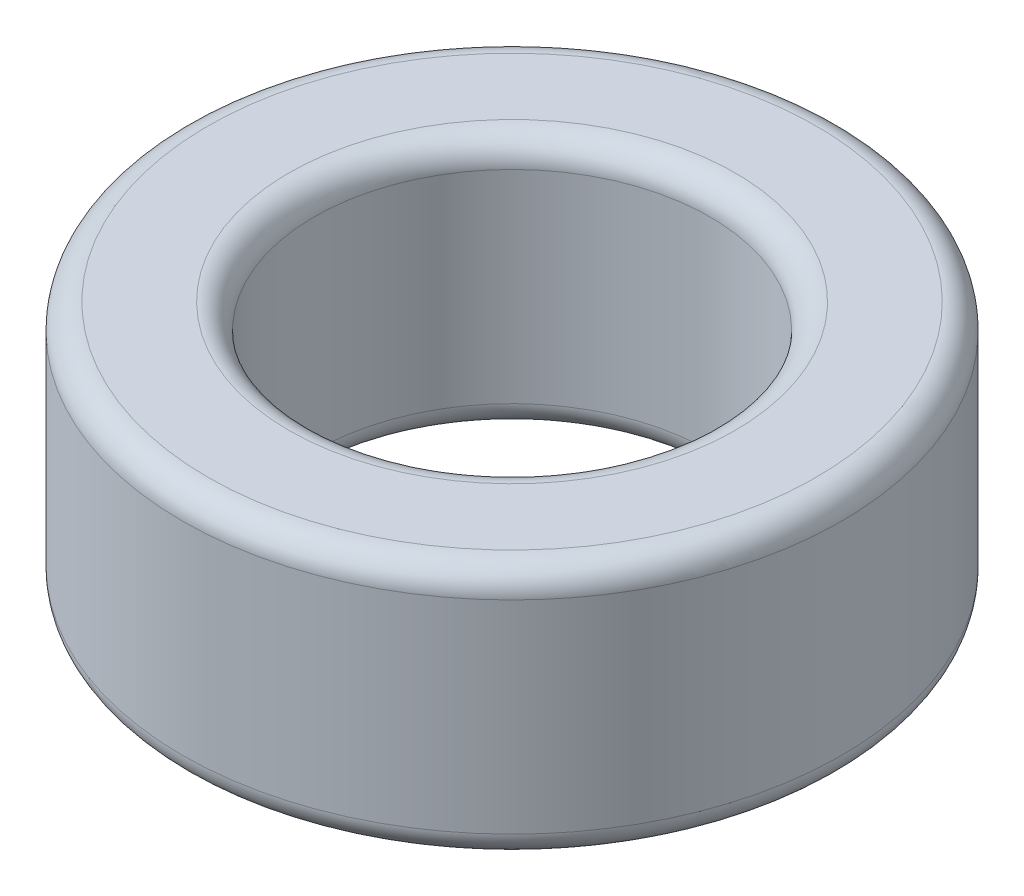
ISO-10303-21;
HEADER;
FILE_DESCRIPTION(('STEP AP214'),'2;1');
FILE_NAME('part.step','',(''),(''),'','','');
FILE_SCHEMA(('AUTOMOTIVE_DESIGN { 1 0 10303 214 1 1 1 1 }'));
ENDSEC;
DATA;
#1=APPLICATION_CONTEXT('core data for automotive mechanical design processes');
#2=APPLICATION_PROTOCOL_DEFINITION('international standard','automotive_design',2000,#1);
#3=PRODUCT_CONTEXT('',#1,'mechanical');
#4=PRODUCT('Part','Part','',(#3));
#5=PRODUCT_RELATED_PRODUCT_CATEGORY('part','',(#4));
#6=PRODUCT_DEFINITION_FORMATION('','',#4);
#7=PRODUCT_DEFINITION_CONTEXT('part definition',#1,'design');
#8=PRODUCT_DEFINITION('design','',#6,#7);
#9=PRODUCT_DEFINITION_SHAPE('','',#8);
#10=(LENGTH_UNIT() NAMED_UNIT(*) SI_UNIT(.MILLI.,.METRE.));
#11=(NAMED_UNIT(*) PLANE_ANGLE_UNIT() SI_UNIT($,.RADIAN.));
#12=(NAMED_UNIT(*) SI_UNIT($,.STERADIAN.) SOLID_ANGLE_UNIT());
#13=UNCERTAINTY_MEASURE_WITH_UNIT(LENGTH_MEASURE(1.E-05),#10,'distance_accuracy_value','');
#14=(GEOMETRIC_REPRESENTATION_CONTEXT(3) GLOBAL_UNCERTAINTY_ASSIGNED_CONTEXT((#13)) GLOBAL_UNIT_ASSIGNED_CONTEXT((#10,
#11,#12)) REPRESENTATION_CONTEXT('',''));
#15=CARTESIAN_POINT('',(0.,0.,0.));
#16=DIRECTION('',(0.,0.,1.));
#17=DIRECTION('',(1.,0.,0.));
#18=AXIS2_PLACEMENT_3D('',#15,#16,#17);
#19=CARTESIAN_POINT('',(0.,-2.5,8.22));
#20=DIRECTION('',(0.,1.,0.));
#21=DIRECTION('',(1.,0.,0.));
#22=AXIS2_PLACEMENT_3D('',#19,#20,#21);
#23=PLANE('',#22);
#24=CARTESIAN_POINT('',(0.,-2.5,8.22));
#25=DIRECTION('',(0.,1.,0.));
#26=DIRECTION('',(0.,0.,1.));
#27=AXIS2_PLACEMENT_3D('',#24,#25,#26);
#28=CIRCLE('',#27,4.4);
#29=CARTESIAN_POINT('',(0.,-2.5,12.62));
#30=VERTEX_POINT('',#29);
#31=EDGE_CURVE('E26',#30,#30,#28,.T.);
#32=ORIENTED_EDGE('',*,*,#31,.T.);
#33=EDGE_LOOP('',(#32));
#34=FACE_BOUND('',#33,.T.);
#35=CARTESIAN_POINT('',(0.,-2.5,8.22));
#36=DIRECTION('',(0.,-1.,0.));
#37=DIRECTION('',(0.,0.,1.));
#38=AXIS2_PLACEMENT_3D('',#35,#36,#37);
#39=CIRCLE('',#38,6.);
#40=CARTESIAN_POINT('',(0.,-2.5,14.22));
#41=VERTEX_POINT('',#40);
#42=EDGE_CURVE('E84',#41,#41,#39,.T.);
#43=ORIENTED_EDGE('',*,*,#42,.T.);
#44=EDGE_LOOP('',(#43));
#45=FACE_BOUND('',#44,.T.);
#46=ADVANCED_FACE('F17',(#34,#45),#23,.F.);
#47=CARTESIAN_POINT('',(0.,-2.5,8.22));
#48=DIRECTION('',(0.,-1.,0.));
#49=DIRECTION('',(0.,0.,1.));
#50=AXIS2_PLACEMENT_3D('',#47,#48,#49);
#51=CYLINDRICAL_SURFACE('',#50,6.5);
#52=CARTESIAN_POINT('',(0.,2.,8.22));
#53=DIRECTION('',(0.,-1.,0.));
#54=DIRECTION('',(0.,0.,1.));
#55=AXIS2_PLACEMENT_3D('',#52,#53,#54);
#56=CIRCLE('',#55,6.5);
#57=CARTESIAN_POINT('',(0.,2.,14.72));
#58=VERTEX_POINT('',#57);
#59=EDGE_CURVE('E67',#58,#58,#56,.T.);
#60=ORIENTED_EDGE('',*,*,#59,.T.);
#61=EDGE_LOOP('',(#60));
#62=FACE_BOUND('',#61,.T.);
#63=CARTESIAN_POINT('',(0.,-2.,8.22));
#64=DIRECTION('',(0.,1.,0.));
#65=DIRECTION('',(0.,0.,1.));
#66=AXIS2_PLACEMENT_3D('',#63,#64,#65);
#67=CIRCLE('',#66,6.5);
#68=CARTESIAN_POINT('',(0.,-2.,14.72));
#69=VERTEX_POINT('',#68);
#70=EDGE_CURVE('E87',#69,#69,#67,.T.);
#71=ORIENTED_EDGE('',*,*,#70,.T.);
#72=EDGE_LOOP('',(#71));
#73=FACE_BOUND('',#72,.T.);
#74=ADVANCED_FACE('F68',(#62,#73),#51,.T.);
#75=CARTESIAN_POINT('',(0.,-2.5,8.22));
#76=DIRECTION('',(0.,-1.,0.));
#77=DIRECTION('',(0.,0.,1.));
#78=AXIS2_PLACEMENT_3D('',#75,#76,#77);
#79=CYLINDRICAL_SURFACE('',#78,3.9);
#80=CARTESIAN_POINT('',(0.,-2.,8.22));
#81=DIRECTION('',(0.,-1.,0.));
#82=DIRECTION('',(0.,0.,1.));
#83=AXIS2_PLACEMENT_3D('',#80,#81,#82);
#84=CIRCLE('',#83,3.9);
#85=CARTESIAN_POINT('',(0.,-2.,12.12));
#86=VERTEX_POINT('',#85);
#87=EDGE_CURVE('E11',#86,#86,#84,.T.);
#88=ORIENTED_EDGE('',*,*,#87,.T.);
#89=EDGE_LOOP('',(#88));
#90=FACE_BOUND('',#89,.T.);
#91=CARTESIAN_POINT('',(0.,2.,8.22));
#92=DIRECTION('',(0.,1.,0.));
#93=DIRECTION('',(0.,0.,1.));
#94=AXIS2_PLACEMENT_3D('',#91,#92,#93);
#95=CIRCLE('',#94,3.9);
#96=CARTESIAN_POINT('',(0.,2.,12.12));
#97=VERTEX_POINT('',#96);
#98=EDGE_CURVE('E72',#97,#97,#95,.T.);
#99=ORIENTED_EDGE('',*,*,#98,.T.);
#100=EDGE_LOOP('',(#99));
#101=FACE_BOUND('',#100,.T.);
#102=ADVANCED_FACE('F110',(#90,#101),#79,.F.);
#103=CARTESIAN_POINT('',(0.,-2.,8.22));
#104=DIRECTION('',(0.,1.,0.));
#105=DIRECTION('',(0.,0.,1.));
#106=AXIS2_PLACEMENT_3D('',#103,#104,#105);
#107=TOROIDAL_SURFACE('',#106,4.4,0.5);
#108=ORIENTED_EDGE('',*,*,#87,.F.);
#109=EDGE_LOOP('',(#108));
#110=FACE_BOUND('',#109,.T.);
#111=ORIENTED_EDGE('',*,*,#31,.F.);
#112=EDGE_LOOP('',(#111));
#113=FACE_BOUND('',#112,.T.);
#114=ADVANCED_FACE('F115',(#110,#113),#107,.T.);
#115=CARTESIAN_POINT('',(0.,-2.,8.22));
#116=DIRECTION('',(0.,1.,0.));
#117=DIRECTION('',(0.,0.,1.));
#118=AXIS2_PLACEMENT_3D('',#115,#116,#117);
#119=TOROIDAL_SURFACE('',#118,6.,0.5);
#120=ORIENTED_EDGE('',*,*,#42,.F.);
#121=EDGE_LOOP('',(#120));
#122=FACE_BOUND('',#121,.T.);
#123=ORIENTED_EDGE('',*,*,#70,.F.);
#124=EDGE_LOOP('',(#123));
#125=FACE_BOUND('',#124,.T.);
#126=ADVANCED_FACE('F19',(#122,#125),#119,.T.);
#127=CARTESIAN_POINT('',(0.,2.5,8.22));
#128=DIRECTION('',(0.,1.,0.));
#129=DIRECTION('',(1.,0.,0.));
#130=AXIS2_PLACEMENT_3D('',#127,#128,#129);
#131=PLANE('',#130);
#132=CARTESIAN_POINT('',(0.,2.5,8.22));
#133=DIRECTION('',(0.,-1.,0.));
#134=DIRECTION('',(0.,0.,1.));
#135=AXIS2_PLACEMENT_3D('',#132,#133,#134);
#136=CIRCLE('',#135,4.4);
#137=CARTESIAN_POINT('',(0.,2.5,12.62));
#138=VERTEX_POINT('',#137);
#139=EDGE_CURVE('E78',#138,#138,#136,.T.);
#140=ORIENTED_EDGE('',*,*,#139,.T.);
#141=EDGE_LOOP('',(#140));
#142=FACE_BOUND('',#141,.T.);
#143=CARTESIAN_POINT('',(0.,2.5,8.22));
#144=DIRECTION('',(0.,1.,0.));
#145=DIRECTION('',(0.,0.,1.));
#146=AXIS2_PLACEMENT_3D('',#143,#144,#145);
#147=CIRCLE('',#146,6.);
#148=CARTESIAN_POINT('',(0.,2.5,14.22));
#149=VERTEX_POINT('',#148);
#150=EDGE_CURVE('E73',#149,#149,#147,.T.);
#151=ORIENTED_EDGE('',*,*,#150,.T.);
#152=EDGE_LOOP('',(#151));
#153=FACE_BOUND('',#152,.T.);
#154=ADVANCED_FACE('F96',(#142,#153),#131,.T.);
#155=CARTESIAN_POINT('',(0.,2.,8.22));
#156=DIRECTION('',(0.,1.,0.));
#157=DIRECTION('',(0.,0.,1.));
#158=AXIS2_PLACEMENT_3D('',#155,#156,#157);
#159=TOROIDAL_SURFACE('',#158,4.4,0.5);
#160=ORIENTED_EDGE('',*,*,#139,.F.);
#161=EDGE_LOOP('',(#160));
#162=FACE_BOUND('',#161,.T.);
#163=ORIENTED_EDGE('',*,*,#98,.F.);
#164=EDGE_LOOP('',(#163));
#165=FACE_BOUND('',#164,.T.);
#166=ADVANCED_FACE('F101',(#162,#165),#159,.T.);
#167=CARTESIAN_POINT('',(0.,2.,8.22));
#168=DIRECTION('',(0.,1.,0.));
#169=DIRECTION('',(0.,0.,1.));
#170=AXIS2_PLACEMENT_3D('',#167,#168,#169);
#171=TOROIDAL_SURFACE('',#170,6.,0.5);
#172=ORIENTED_EDGE('',*,*,#59,.F.);
#173=EDGE_LOOP('',(#172));
#174=FACE_BOUND('',#173,.T.);
#175=ORIENTED_EDGE('',*,*,#150,.F.);
#176=EDGE_LOOP('',(#175));
#177=FACE_BOUND('',#176,.T.);
#178=ADVANCED_FACE('F133',(#174,#177),#171,.T.);
#179=CLOSED_SHELL('',(#46,#74,#102,#114,#126,#154,#166,#178));
#180=MANIFOLD_SOLID_BREP('B1',#179);
#181=ADVANCED_BREP_SHAPE_REPRESENTATION('',(#18,#180),#14);
#182=SHAPE_DEFINITION_REPRESENTATION(#9,#181);
ENDSEC;
END-ISO-10303-21;
